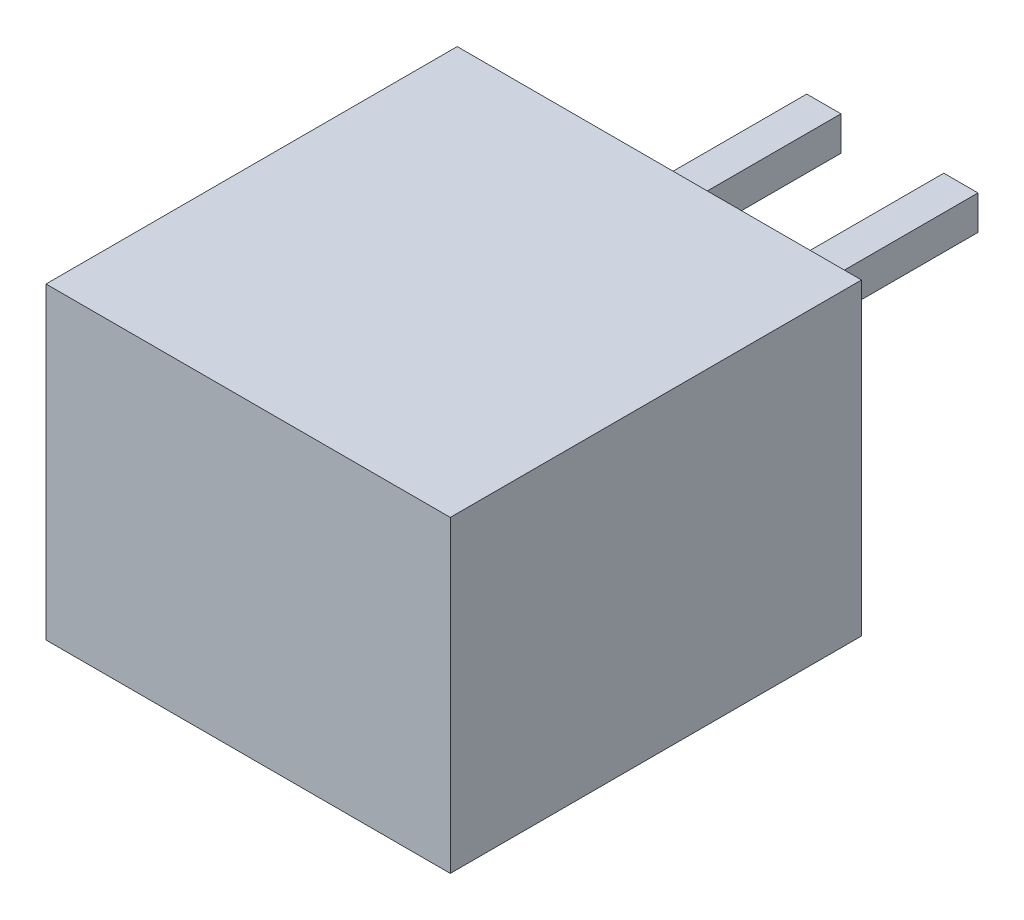
ISO-10303-21;
HEADER;
FILE_DESCRIPTION(('STEP AP214'),'2;1');
FILE_NAME('part.step','',(''),(''),'','','');
FILE_SCHEMA(('AUTOMOTIVE_DESIGN { 1 0 10303 214 1 1 1 1 }'));
ENDSEC;
DATA;
#1=APPLICATION_CONTEXT('core data for automotive mechanical design processes');
#2=APPLICATION_PROTOCOL_DEFINITION('international standard','automotive_design',2000,#1);
#3=PRODUCT_CONTEXT('',#1,'mechanical');
#4=PRODUCT('Part','Part','',(#3));
#5=PRODUCT_RELATED_PRODUCT_CATEGORY('part','',(#4));
#6=PRODUCT_DEFINITION_FORMATION('','',#4);
#7=PRODUCT_DEFINITION_CONTEXT('part definition',#1,'design');
#8=PRODUCT_DEFINITION('design','',#6,#7);
#9=PRODUCT_DEFINITION_SHAPE('','',#8);
#10=(LENGTH_UNIT() NAMED_UNIT(*) SI_UNIT(.MILLI.,.METRE.));
#11=(NAMED_UNIT(*) PLANE_ANGLE_UNIT() SI_UNIT($,.RADIAN.));
#12=(NAMED_UNIT(*) SI_UNIT($,.STERADIAN.) SOLID_ANGLE_UNIT());
#13=UNCERTAINTY_MEASURE_WITH_UNIT(LENGTH_MEASURE(1.E-05),#10,'distance_accuracy_value','');
#14=(GEOMETRIC_REPRESENTATION_CONTEXT(3) GLOBAL_UNCERTAINTY_ASSIGNED_CONTEXT((#13)) GLOBAL_UNIT_ASSIGNED_CONTEXT((#10,
#11,#12)) REPRESENTATION_CONTEXT('',''));
#15=CARTESIAN_POINT('',(0.,0.,0.));
#16=DIRECTION('',(0.,0.,1.));
#17=DIRECTION('',(1.,0.,0.));
#18=AXIS2_PLACEMENT_3D('',#15,#16,#17);
#19=CARTESIAN_POINT('',(0.75042522,0.79957422,-3.40000082));
#20=DIRECTION('',(1.,0.,0.));
#21=DIRECTION('',(0.,-1.,0.));
#22=AXIS2_PLACEMENT_3D('',#19,#20,#21);
#23=PLANE('',#22);
#24=DIRECTION('',(0.,-1.,0.));
#25=VECTOR('',#24,1.);
#26=CARTESIAN_POINT('',(0.75042522,0.79957422,-3.40000082));
#27=LINE('',#26,#25);
#28=CARTESIAN_POINT('',(0.75042522,0.79957422,-3.40000082));
#29=VERTEX_POINT('',#28);
#30=CARTESIAN_POINT('',(0.75042522,0.30058614,-3.40000082));
#31=VERTEX_POINT('',#30);
#32=EDGE_CURVE('P0_E10',#29,#31,#27,.T.);
#33=ORIENTED_EDGE('',*,*,#32,.T.);
#34=DIRECTION('',(0.,0.,1.));
#35=VECTOR('',#34,1.);
#36=CARTESIAN_POINT('',(0.75042522,0.30058614,-3.40000082));
#37=LINE('',#36,#35);
#38=CARTESIAN_POINT('',(0.75042522,0.30058614,0.));
#39=VERTEX_POINT('',#38);
#40=EDGE_CURVE('P0_E23',#31,#39,#37,.T.);
#41=ORIENTED_EDGE('',*,*,#40,.T.);
#42=DIRECTION('',(0.,-1.,0.));
#43=VECTOR('',#42,1.);
#44=CARTESIAN_POINT('',(0.75042522,0.79957422,0.));
#45=LINE('',#44,#43);
#46=CARTESIAN_POINT('',(0.75042522,0.79957422,0.));
#47=VERTEX_POINT('',#46);
#48=EDGE_CURVE('P0_E86',#47,#39,#45,.T.);
#49=ORIENTED_EDGE('',*,*,#48,.F.);
#50=DIRECTION('',(0.,0.,1.));
#51=VECTOR('',#50,1.);
#52=CARTESIAN_POINT('',(0.75042522,0.79957422,-3.40000082));
#53=LINE('',#52,#51);
#54=EDGE_CURVE('P0_E37',#29,#47,#53,.T.);
#55=ORIENTED_EDGE('',*,*,#54,.F.);
#56=EDGE_LOOP('',(#33,#41,#49,#55));
#57=FACE_BOUND('',#56,.T.);
#58=ADVANCED_FACE('P0_F16',(#57),#23,.F.);
#59=CARTESIAN_POINT('',(0.75042522,0.30058614,-3.40000082));
#60=DIRECTION('',(0.,1.,0.));
#61=DIRECTION('',(1.,0.,0.));
#62=AXIS2_PLACEMENT_3D('',#59,#60,#61);
#63=PLANE('',#62);
#64=DIRECTION('',(1.,0.,0.));
#65=VECTOR('',#64,1.);
#66=CARTESIAN_POINT('',(0.75042522,0.30058614,-3.40000082));
#67=LINE('',#66,#65);
#68=CARTESIAN_POINT('',(1.2494133,0.30058614,-3.40000082));
#69=VERTEX_POINT('',#68);
#70=EDGE_CURVE('P0_E30',#31,#69,#67,.T.);
#71=ORIENTED_EDGE('',*,*,#70,.T.);
#72=DIRECTION('',(0.,0.,1.));
#73=VECTOR('',#72,1.);
#74=CARTESIAN_POINT('',(1.2494133,0.30058614,-3.40000082));
#75=LINE('',#74,#73);
#76=CARTESIAN_POINT('',(1.2494133,0.30058614,0.));
#77=VERTEX_POINT('',#76);
#78=EDGE_CURVE('P0_E82',#69,#77,#75,.T.);
#79=ORIENTED_EDGE('',*,*,#78,.T.);
#80=DIRECTION('',(1.,0.,0.));
#81=VECTOR('',#80,1.);
#82=CARTESIAN_POINT('',(0.75042522,0.30058614,0.));
#83=LINE('',#82,#81);
#84=EDGE_CURVE('P0_E63',#39,#77,#83,.T.);
#85=ORIENTED_EDGE('',*,*,#84,.F.);
#86=ORIENTED_EDGE('',*,*,#40,.F.);
#87=EDGE_LOOP('',(#71,#79,#85,#86));
#88=FACE_BOUND('',#87,.T.);
#89=ADVANCED_FACE('P0_F89',(#88),#63,.F.);
#90=CARTESIAN_POINT('',(1.2494133,0.30058614,-3.40000082));
#91=DIRECTION('',(-1.,0.,0.));
#92=DIRECTION('',(0.,1.,0.));
#93=AXIS2_PLACEMENT_3D('',#90,#91,#92);
#94=PLANE('',#93);
#95=DIRECTION('',(0.,1.,0.));
#96=VECTOR('',#95,1.);
#97=CARTESIAN_POINT('',(1.2494133,0.30058614,-3.40000082));
#98=LINE('',#97,#96);
#99=CARTESIAN_POINT('',(1.2494133,0.79957422,-3.40000082));
#100=VERTEX_POINT('',#99);
#101=EDGE_CURVE('P0_E72',#69,#100,#98,.T.);
#102=ORIENTED_EDGE('',*,*,#101,.T.);
#103=DIRECTION('',(0.,0.,1.));
#104=VECTOR('',#103,1.);
#105=CARTESIAN_POINT('',(1.2494133,0.79957422,-3.40000082));
#106=LINE('',#105,#104);
#107=CARTESIAN_POINT('',(1.2494133,0.79957422,0.));
#108=VERTEX_POINT('',#107);
#109=EDGE_CURVE('P0_E67',#100,#108,#106,.T.);
#110=ORIENTED_EDGE('',*,*,#109,.T.);
#111=DIRECTION('',(0.,1.,0.));
#112=VECTOR('',#111,1.);
#113=CARTESIAN_POINT('',(1.2494133,0.30058614,0.));
#114=LINE('',#113,#112);
#115=EDGE_CURVE('P0_E57',#77,#108,#114,.T.);
#116=ORIENTED_EDGE('',*,*,#115,.F.);
#117=ORIENTED_EDGE('',*,*,#78,.F.);
#118=EDGE_LOOP('',(#102,#110,#116,#117));
#119=FACE_BOUND('',#118,.T.);
#120=ADVANCED_FACE('P0_F71',(#119),#94,.F.);
#121=CARTESIAN_POINT('',(1.2494133,0.79957422,-3.40000082));
#122=DIRECTION('',(0.,-1.,0.));
#123=DIRECTION('',(-1.,0.,0.));
#124=AXIS2_PLACEMENT_3D('',#121,#122,#123);
#125=PLANE('',#124);
#126=DIRECTION('',(-1.,0.,0.));
#127=VECTOR('',#126,1.);
#128=CARTESIAN_POINT('',(1.2494133,0.79957422,-3.40000082));
#129=LINE('',#128,#127);
#130=EDGE_CURVE('P0_E68',#100,#29,#129,.T.);
#131=ORIENTED_EDGE('',*,*,#130,.T.);
#132=ORIENTED_EDGE('',*,*,#54,.T.);
#133=DIRECTION('',(-1.,0.,0.));
#134=VECTOR('',#133,1.);
#135=CARTESIAN_POINT('',(1.2494133,0.79957422,0.));
#136=LINE('',#135,#134);
#137=EDGE_CURVE('P0_E61',#108,#47,#136,.T.);
#138=ORIENTED_EDGE('',*,*,#137,.F.);
#139=ORIENTED_EDGE('',*,*,#109,.F.);
#140=EDGE_LOOP('',(#131,#132,#138,#139));
#141=FACE_BOUND('',#140,.T.);
#142=ADVANCED_FACE('P0_F76',(#141),#125,.F.);
#143=CARTESIAN_POINT('',(0.99991926,0.55008018,-3.40000082));
#144=DIRECTION('',(0.,0.,1.));
#145=DIRECTION('',(-1.,0.,0.));
#146=AXIS2_PLACEMENT_3D('',#143,#144,#145);
#147=PLANE('',#146);
#148=ORIENTED_EDGE('',*,*,#130,.F.);
#149=ORIENTED_EDGE('',*,*,#101,.F.);
#150=ORIENTED_EDGE('',*,*,#70,.F.);
#151=ORIENTED_EDGE('',*,*,#32,.F.);
#152=EDGE_LOOP('',(#148,#149,#150,#151));
#153=FACE_BOUND('',#152,.T.);
#154=ADVANCED_FACE('P0_F90',(#153),#147,.F.);
#155=CARTESIAN_POINT('',(0.99991926,0.55008018,0.));
#156=DIRECTION('',(0.,0.,1.));
#157=DIRECTION('',(-1.,0.,0.));
#158=AXIS2_PLACEMENT_3D('',#155,#156,#157);
#159=PLANE('',#158);
#160=ORIENTED_EDGE('',*,*,#48,.T.);
#161=ORIENTED_EDGE('',*,*,#84,.T.);
#162=ORIENTED_EDGE('',*,*,#115,.T.);
#163=ORIENTED_EDGE('',*,*,#137,.T.);
#164=EDGE_LOOP('',(#160,#161,#162,#163));
#165=FACE_BOUND('',#164,.T.);
#166=ADVANCED_FACE('P0_F59',(#165),#159,.T.);
#167=CLOSED_SHELL('',(#58,#89,#120,#142,#154,#166));
#168=MANIFOLD_SOLID_BREP('P0_B1',#167);
#169=CARTESIAN_POINT('',(-1.24949458,0.79949294,-3.40000082));
#170=DIRECTION('',(1.,0.,0.));
#171=DIRECTION('',(0.,-1.,0.));
#172=AXIS2_PLACEMENT_3D('',#169,#170,#171);
#173=PLANE('',#172);
#174=DIRECTION('',(0.,-1.,0.));
#175=VECTOR('',#174,1.);
#176=CARTESIAN_POINT('',(-1.24949458,0.79949294,-3.40000082));
#177=LINE('',#176,#175);
#178=CARTESIAN_POINT('',(-1.24949458,0.79949294,-3.40000082));
#179=VERTEX_POINT('',#178);
#180=CARTESIAN_POINT('',(-1.24949458,0.30050486,-3.40000082));
#181=VERTEX_POINT('',#180);
#182=EDGE_CURVE('P1_E11',#179,#181,#177,.T.);
#183=ORIENTED_EDGE('',*,*,#182,.T.);
#184=DIRECTION('',(0.,0.,1.));
#185=VECTOR('',#184,1.);
#186=CARTESIAN_POINT('',(-1.24949458,0.30050486,-3.40000082));
#187=LINE('',#186,#185);
#188=CARTESIAN_POINT('',(-1.24949458,0.30050486,0.));
#189=VERTEX_POINT('',#188);
#190=EDGE_CURVE('P1_E24',#181,#189,#187,.T.);
#191=ORIENTED_EDGE('',*,*,#190,.T.);
#192=DIRECTION('',(0.,-1.,0.));
#193=VECTOR('',#192,1.);
#194=CARTESIAN_POINT('',(-1.24949458,0.79949294,0.));
#195=LINE('',#194,#193);
#196=CARTESIAN_POINT('',(-1.24949458,0.79949294,0.));
#197=VERTEX_POINT('',#196);
#198=EDGE_CURVE('P1_E87',#197,#189,#195,.T.);
#199=ORIENTED_EDGE('',*,*,#198,.F.);
#200=DIRECTION('',(0.,0.,1.));
#201=VECTOR('',#200,1.);
#202=CARTESIAN_POINT('',(-1.24949458,0.79949294,-3.40000082));
#203=LINE('',#202,#201);
#204=EDGE_CURVE('P1_E38',#179,#197,#203,.T.);
#205=ORIENTED_EDGE('',*,*,#204,.F.);
#206=EDGE_LOOP('',(#183,#191,#199,#205));
#207=FACE_BOUND('',#206,.T.);
#208=ADVANCED_FACE('P1_F17',(#207),#173,.F.);
#209=CARTESIAN_POINT('',(-1.24949458,0.30050486,-3.40000082));
#210=DIRECTION('',(0.,1.,0.));
#211=DIRECTION('',(1.,0.,0.));
#212=AXIS2_PLACEMENT_3D('',#209,#210,#211);
#213=PLANE('',#212);
#214=DIRECTION('',(1.,0.,0.));
#215=VECTOR('',#214,1.);
#216=CARTESIAN_POINT('',(-1.24949458,0.30050486,-3.40000082));
#217=LINE('',#216,#215);
#218=CARTESIAN_POINT('',(-0.7505065,0.30050486,-3.40000082));
#219=VERTEX_POINT('',#218);
#220=EDGE_CURVE('P1_E31',#181,#219,#217,.T.);
#221=ORIENTED_EDGE('',*,*,#220,.T.);
#222=DIRECTION('',(0.,0.,1.));
#223=VECTOR('',#222,1.);
#224=CARTESIAN_POINT('',(-0.7505065,0.30050486,-3.40000082));
#225=LINE('',#224,#223);
#226=CARTESIAN_POINT('',(-0.7505065,0.30050486,0.));
#227=VERTEX_POINT('',#226);
#228=EDGE_CURVE('P1_E83',#219,#227,#225,.T.);
#229=ORIENTED_EDGE('',*,*,#228,.T.);
#230=DIRECTION('',(1.,0.,0.));
#231=VECTOR('',#230,1.);
#232=CARTESIAN_POINT('',(-1.24949458,0.30050486,0.));
#233=LINE('',#232,#231);
#234=EDGE_CURVE('P1_E63',#189,#227,#233,.T.);
#235=ORIENTED_EDGE('',*,*,#234,.F.);
#236=ORIENTED_EDGE('',*,*,#190,.F.);
#237=EDGE_LOOP('',(#221,#229,#235,#236));
#238=FACE_BOUND('',#237,.T.);
#239=ADVANCED_FACE('P1_F90',(#238),#213,.F.);
#240=CARTESIAN_POINT('',(-0.7505065,0.30050486,-3.40000082));
#241=DIRECTION('',(-1.,0.,0.));
#242=DIRECTION('',(0.,1.,0.));
#243=AXIS2_PLACEMENT_3D('',#240,#241,#242);
#244=PLANE('',#243);
#245=DIRECTION('',(0.,1.,0.));
#246=VECTOR('',#245,1.);
#247=CARTESIAN_POINT('',(-0.7505065,0.30050486,-3.40000082));
#248=LINE('',#247,#246);
#249=CARTESIAN_POINT('',(-0.7505065,0.79949294,-3.40000082));
#250=VERTEX_POINT('',#249);
#251=EDGE_CURVE('P1_E72',#219,#250,#248,.T.);
#252=ORIENTED_EDGE('',*,*,#251,.T.);
#253=DIRECTION('',(0.,0.,1.));
#254=VECTOR('',#253,1.);
#255=CARTESIAN_POINT('',(-0.7505065,0.79949294,-3.40000082));
#256=LINE('',#255,#254);
#257=CARTESIAN_POINT('',(-0.7505065,0.79949294,0.));
#258=VERTEX_POINT('',#257);
#259=EDGE_CURVE('P1_E67',#250,#258,#256,.T.);
#260=ORIENTED_EDGE('',*,*,#259,.T.);
#261=DIRECTION('',(0.,1.,0.));
#262=VECTOR('',#261,1.);
#263=CARTESIAN_POINT('',(-0.7505065,0.30050486,0.));
#264=LINE('',#263,#262);
#265=EDGE_CURVE('P1_E57',#227,#258,#264,.T.);
#266=ORIENTED_EDGE('',*,*,#265,.F.);
#267=ORIENTED_EDGE('',*,*,#228,.F.);
#268=EDGE_LOOP('',(#252,#260,#266,#267));
#269=FACE_BOUND('',#268,.T.);
#270=ADVANCED_FACE('P1_F71',(#269),#244,.F.);
#271=CARTESIAN_POINT('',(-0.7505065,0.79949294,-3.40000082));
#272=DIRECTION('',(0.,-1.,0.));
#273=DIRECTION('',(-1.,0.,0.));
#274=AXIS2_PLACEMENT_3D('',#271,#272,#273);
#275=PLANE('',#274);
#276=DIRECTION('',(-1.,0.,0.));
#277=VECTOR('',#276,1.);
#278=CARTESIAN_POINT('',(-0.7505065,0.79949294,-3.40000082));
#279=LINE('',#278,#277);
#280=EDGE_CURVE('P1_E68',#250,#179,#279,.T.);
#281=ORIENTED_EDGE('',*,*,#280,.T.);
#282=ORIENTED_EDGE('',*,*,#204,.T.);
#283=DIRECTION('',(-1.,0.,0.));
#284=VECTOR('',#283,1.);
#285=CARTESIAN_POINT('',(-0.7505065,0.79949294,0.));
#286=LINE('',#285,#284);
#287=EDGE_CURVE('P1_E61',#258,#197,#286,.T.);
#288=ORIENTED_EDGE('',*,*,#287,.F.);
#289=ORIENTED_EDGE('',*,*,#259,.F.);
#290=EDGE_LOOP('',(#281,#282,#288,#289));
#291=FACE_BOUND('',#290,.T.);
#292=ADVANCED_FACE('P1_F77',(#291),#275,.F.);
#293=CARTESIAN_POINT('',(-1.00000054,0.5499989,-3.40000082));
#294=DIRECTION('',(0.,0.,1.));
#295=DIRECTION('',(-1.,0.,0.));
#296=AXIS2_PLACEMENT_3D('',#293,#294,#295);
#297=PLANE('',#296);
#298=ORIENTED_EDGE('',*,*,#280,.F.);
#299=ORIENTED_EDGE('',*,*,#251,.F.);
#300=ORIENTED_EDGE('',*,*,#220,.F.);
#301=ORIENTED_EDGE('',*,*,#182,.F.);
#302=EDGE_LOOP('',(#298,#299,#300,#301));
#303=FACE_BOUND('',#302,.T.);
#304=ADVANCED_FACE('P1_F91',(#303),#297,.F.);
#305=CARTESIAN_POINT('',(-1.00000054,0.5499989,0.));
#306=DIRECTION('',(0.,0.,1.));
#307=DIRECTION('',(-1.,0.,0.));
#308=AXIS2_PLACEMENT_3D('',#305,#306,#307);
#309=PLANE('',#308);
#310=ORIENTED_EDGE('',*,*,#198,.T.);
#311=ORIENTED_EDGE('',*,*,#234,.T.);
#312=ORIENTED_EDGE('',*,*,#265,.T.);
#313=ORIENTED_EDGE('',*,*,#287,.T.);
#314=EDGE_LOOP('',(#310,#311,#312,#313));
#315=FACE_BOUND('',#314,.T.);
#316=ADVANCED_FACE('P1_F59',(#315),#309,.T.);
#317=CLOSED_SHELL('',(#208,#239,#270,#292,#304,#316));
#318=MANIFOLD_SOLID_BREP('P1_B1',#317);
#319=CARTESIAN_POINT('',(2.94949118,2.24949258,0.));
#320=DIRECTION('',(1.,0.,0.));
#321=DIRECTION('',(0.,-1.,0.));
#322=AXIS2_PLACEMENT_3D('',#319,#320,#321);
#323=PLANE('',#322);
#324=DIRECTION('',(0.,0.,1.));
#325=VECTOR('',#324,1.);
#326=CARTESIAN_POINT('',(2.94949118,2.24949258,0.));
#327=LINE('',#326,#325);
#328=CARTESIAN_POINT('',(2.94949118,2.24949258,0.));
#329=VERTEX_POINT('',#328);
#330=CARTESIAN_POINT('',(2.94949118,2.24949258,6.0000007));
#331=VERTEX_POINT('',#330);
#332=EDGE_CURVE('P2_E10',#329,#331,#327,.T.);
#333=ORIENTED_EDGE('',*,*,#332,.T.);
#334=DIRECTION('',(0.,-1.,0.));
#335=VECTOR('',#334,1.);
#336=CARTESIAN_POINT('',(2.94949118,2.24949258,6.0000007));
#337=LINE('',#336,#335);
#338=CARTESIAN_POINT('',(2.94949118,-2.24949258,6.0000007));
#339=VERTEX_POINT('',#338);
#340=EDGE_CURVE('P2_E23',#331,#339,#337,.T.);
#341=ORIENTED_EDGE('',*,*,#340,.T.);
#342=DIRECTION('',(0.,0.,1.));
#343=VECTOR('',#342,1.);
#344=CARTESIAN_POINT('',(2.94949118,-2.24949258,0.));
#345=LINE('',#344,#343);
#346=CARTESIAN_POINT('',(2.94949118,-2.24949258,0.));
#347=VERTEX_POINT('',#346);
#348=EDGE_CURVE('P2_E84',#347,#339,#345,.T.);
#349=ORIENTED_EDGE('',*,*,#348,.F.);
#350=DIRECTION('',(0.,-1.,0.));
#351=VECTOR('',#350,1.);
#352=CARTESIAN_POINT('',(2.94949118,2.24949258,0.));
#353=LINE('',#352,#351);
#354=EDGE_CURVE('P2_E82',#329,#347,#353,.T.);
#355=ORIENTED_EDGE('',*,*,#354,.F.);
#356=EDGE_LOOP('',(#333,#341,#349,#355));
#357=FACE_BOUND('',#356,.T.);
#358=ADVANCED_FACE('P2_F16',(#357),#323,.T.);
#359=CARTESIAN_POINT('',(2.94949118,-2.24949258,0.));
#360=DIRECTION('',(0.,-1.,0.));
#361=DIRECTION('',(-1.,0.,0.));
#362=AXIS2_PLACEMENT_3D('',#359,#360,#361);
#363=PLANE('',#362);
#364=ORIENTED_EDGE('',*,*,#348,.T.);
#365=DIRECTION('',(-1.,0.,0.));
#366=VECTOR('',#365,1.);
#367=CARTESIAN_POINT('',(2.94949118,-2.24949258,6.0000007));
#368=LINE('',#367,#366);
#369=CARTESIAN_POINT('',(-2.94949118,-2.24949258,6.0000007));
#370=VERTEX_POINT('',#369);
#371=EDGE_CURVE('P2_E80',#339,#370,#368,.T.);
#372=ORIENTED_EDGE('',*,*,#371,.T.);
#373=DIRECTION('',(0.,0.,1.));
#374=VECTOR('',#373,1.);
#375=CARTESIAN_POINT('',(-2.94949118,-2.24949258,0.));
#376=LINE('',#375,#374);
#377=CARTESIAN_POINT('',(-2.94949118,-2.24949258,0.));
#378=VERTEX_POINT('',#377);
#379=EDGE_CURVE('P2_E78',#378,#370,#376,.T.);
#380=ORIENTED_EDGE('',*,*,#379,.F.);
#381=DIRECTION('',(-1.,0.,0.));
#382=VECTOR('',#381,1.);
#383=CARTESIAN_POINT('',(2.94949118,-2.24949258,0.));
#384=LINE('',#383,#382);
#385=EDGE_CURVE('P2_E69',#347,#378,#384,.T.);
#386=ORIENTED_EDGE('',*,*,#385,.F.);
#387=EDGE_LOOP('',(#364,#372,#380,#386));
#388=FACE_BOUND('',#387,.T.);
#389=ADVANCED_FACE('P2_F89',(#388),#363,.T.);
#390=CARTESIAN_POINT('',(-2.94949118,-2.24949258,0.));
#391=DIRECTION('',(-1.,0.,0.));
#392=DIRECTION('',(0.,1.,0.));
#393=AXIS2_PLACEMENT_3D('',#390,#391,#392);
#394=PLANE('',#393);
#395=ORIENTED_EDGE('',*,*,#379,.T.);
#396=DIRECTION('',(0.,1.,0.));
#397=VECTOR('',#396,1.);
#398=CARTESIAN_POINT('',(-2.94949118,-2.24949258,6.0000007));
#399=LINE('',#398,#397);
#400=CARTESIAN_POINT('',(-2.94949118,2.24949258,6.0000007));
#401=VERTEX_POINT('',#400);
#402=EDGE_CURVE('P2_E59',#370,#401,#399,.T.);
#403=ORIENTED_EDGE('',*,*,#402,.T.);
#404=DIRECTION('',(0.,0.,1.));
#405=VECTOR('',#404,1.);
#406=CARTESIAN_POINT('',(-2.94949118,2.24949258,0.));
#407=LINE('',#406,#405);
#408=CARTESIAN_POINT('',(-2.94949118,2.24949258,0.));
#409=VERTEX_POINT('',#408);
#410=EDGE_CURVE('P2_E53',#409,#401,#407,.T.);
#411=ORIENTED_EDGE('',*,*,#410,.F.);
#412=DIRECTION('',(0.,1.,0.));
#413=VECTOR('',#412,1.);
#414=CARTESIAN_POINT('',(-2.94949118,-2.24949258,0.));
#415=LINE('',#414,#413);
#416=EDGE_CURVE('P2_E57',#378,#409,#415,.T.);
#417=ORIENTED_EDGE('',*,*,#416,.F.);
#418=EDGE_LOOP('',(#395,#403,#411,#417));
#419=FACE_BOUND('',#418,.T.);
#420=ADVANCED_FACE('P2_F56',(#419),#394,.T.);
#421=CARTESIAN_POINT('',(-2.94949118,2.24949258,0.));
#422=DIRECTION('',(0.,1.,0.));
#423=DIRECTION('',(1.,0.,0.));
#424=AXIS2_PLACEMENT_3D('',#421,#422,#423);
#425=PLANE('',#424);
#426=ORIENTED_EDGE('',*,*,#410,.T.);
#427=DIRECTION('',(1.,0.,0.));
#428=VECTOR('',#427,1.);
#429=CARTESIAN_POINT('',(-2.94949118,2.24949258,6.0000007));
#430=LINE('',#429,#428);
#431=EDGE_CURVE('P2_E70',#401,#331,#430,.T.);
#432=ORIENTED_EDGE('',*,*,#431,.T.);
#433=ORIENTED_EDGE('',*,*,#332,.F.);
#434=DIRECTION('',(1.,0.,0.));
#435=VECTOR('',#434,1.);
#436=CARTESIAN_POINT('',(-2.94949118,2.24949258,0.));
#437=LINE('',#436,#435);
#438=EDGE_CURVE('P2_E67',#409,#329,#437,.T.);
#439=ORIENTED_EDGE('',*,*,#438,.F.);
#440=EDGE_LOOP('',(#426,#432,#433,#439));
#441=FACE_BOUND('',#440,.T.);
#442=ADVANCED_FACE('P2_F72',(#441),#425,.T.);
#443=CARTESIAN_POINT('',(0.,0.,0.));
#444=DIRECTION('',(0.,0.,-1.));
#445=DIRECTION('',(1.,0.,0.));
#446=AXIS2_PLACEMENT_3D('',#443,#444,#445);
#447=PLANE('',#446);
#448=ORIENTED_EDGE('',*,*,#354,.T.);
#449=ORIENTED_EDGE('',*,*,#385,.T.);
#450=ORIENTED_EDGE('',*,*,#416,.T.);
#451=ORIENTED_EDGE('',*,*,#438,.T.);
#452=EDGE_LOOP('',(#448,#449,#450,#451));
#453=FACE_BOUND('',#452,.T.);
#454=ADVANCED_FACE('P2_F66',(#453),#447,.T.);
#455=CARTESIAN_POINT('',(0.,0.,6.0000007));
#456=DIRECTION('',(0.,0.,-1.));
#457=DIRECTION('',(1.,0.,0.));
#458=AXIS2_PLACEMENT_3D('',#455,#456,#457);
#459=PLANE('',#458);
#460=ORIENTED_EDGE('',*,*,#431,.F.);
#461=ORIENTED_EDGE('',*,*,#402,.F.);
#462=ORIENTED_EDGE('',*,*,#371,.F.);
#463=ORIENTED_EDGE('',*,*,#340,.F.);
#464=EDGE_LOOP('',(#460,#461,#462,#463));
#465=FACE_BOUND('',#464,.T.);
#466=ADVANCED_FACE('P2_F90',(#465),#459,.F.);
#467=CLOSED_SHELL('',(#358,#389,#420,#442,#454,#466));
#468=MANIFOLD_SOLID_BREP('P2_B1',#467);
#469=ADVANCED_BREP_SHAPE_REPRESENTATION('',(#18,#168,#318,#468),#14);
#470=SHAPE_DEFINITION_REPRESENTATION(#9,#469);
ENDSEC;
END-ISO-10303-21;
